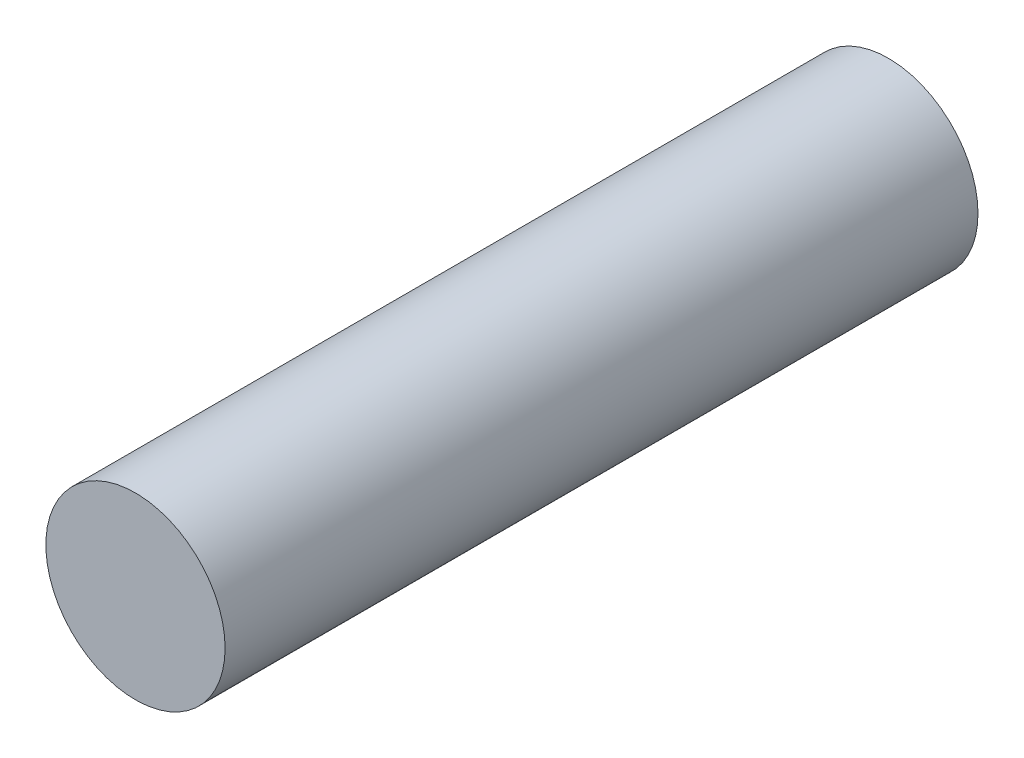
ISO-10303-21;
HEADER;
FILE_DESCRIPTION(('STEP AP214'),'2;1');
FILE_NAME('part.step','',(''),(''),'','','');
FILE_SCHEMA(('AUTOMOTIVE_DESIGN { 1 0 10303 214 1 1 1 1 }'));
ENDSEC;
DATA;
#1=APPLICATION_CONTEXT('core data for automotive mechanical design processes');
#2=APPLICATION_PROTOCOL_DEFINITION('international standard','automotive_design',2000,#1);
#3=PRODUCT_CONTEXT('',#1,'mechanical');
#4=PRODUCT('Part','Part','',(#3));
#5=PRODUCT_RELATED_PRODUCT_CATEGORY('part','',(#4));
#6=PRODUCT_DEFINITION_FORMATION('','',#4);
#7=PRODUCT_DEFINITION_CONTEXT('part definition',#1,'design');
#8=PRODUCT_DEFINITION('design','',#6,#7);
#9=PRODUCT_DEFINITION_SHAPE('','',#8);
#10=(LENGTH_UNIT() NAMED_UNIT(*) SI_UNIT(.MILLI.,.METRE.));
#11=(NAMED_UNIT(*) PLANE_ANGLE_UNIT() SI_UNIT($,.RADIAN.));
#12=(NAMED_UNIT(*) SI_UNIT($,.STERADIAN.) SOLID_ANGLE_UNIT());
#13=UNCERTAINTY_MEASURE_WITH_UNIT(LENGTH_MEASURE(1.E-05),#10,'distance_accuracy_value','');
#14=(GEOMETRIC_REPRESENTATION_CONTEXT(3) GLOBAL_UNCERTAINTY_ASSIGNED_CONTEXT((#13)) GLOBAL_UNIT_ASSIGNED_CONTEXT((#10,
#11,#12)) REPRESENTATION_CONTEXT('',''));
#15=CARTESIAN_POINT('',(0.,0.,0.));
#16=DIRECTION('',(0.,0.,1.));
#17=DIRECTION('',(1.,0.,0.));
#18=AXIS2_PLACEMENT_3D('',#15,#16,#17);
#19=CARTESIAN_POINT('',(0.,0.,63.));
#20=DIRECTION('',(0.,0.,-1.));
#21=DIRECTION('',(-1.,0.,0.));
#22=AXIS2_PLACEMENT_3D('',#19,#20,#21);
#23=CYLINDRICAL_SURFACE('',#22,7.5);
#24=CARTESIAN_POINT('',(0.,0.,63.));
#25=DIRECTION('',(0.,0.,1.));
#26=DIRECTION('',(1.,0.,0.));
#27=AXIS2_PLACEMENT_3D('',#24,#25,#26);
#28=CIRCLE('',#27,7.5);
#29=CARTESIAN_POINT('',(7.5,0.,63.));
#30=VERTEX_POINT('',#29);
#31=EDGE_CURVE('E10',#30,#30,#28,.T.);
#32=ORIENTED_EDGE('',*,*,#31,.F.);
#33=EDGE_LOOP('',(#32));
#34=FACE_BOUND('',#33,.T.);
#35=CARTESIAN_POINT('',(0.,0.,0.));
#36=DIRECTION('',(0.,0.,1.));
#37=DIRECTION('',(1.,0.,0.));
#38=AXIS2_PLACEMENT_3D('',#35,#36,#37);
#39=CIRCLE('',#38,7.5);
#40=CARTESIAN_POINT('',(7.5,0.,0.));
#41=VERTEX_POINT('',#40);
#42=EDGE_CURVE('E44',#41,#41,#39,.T.);
#43=ORIENTED_EDGE('',*,*,#42,.T.);
#44=EDGE_LOOP('',(#43));
#45=FACE_BOUND('',#44,.T.);
#46=ADVANCED_FACE('F41',(#34,#45),#23,.T.);
#47=CARTESIAN_POINT('',(0.,0.,63.));
#48=DIRECTION('',(0.,0.,1.));
#49=DIRECTION('',(1.,0.,0.));
#50=AXIS2_PLACEMENT_3D('',#47,#48,#49);
#51=PLANE('',#50);
#52=ORIENTED_EDGE('',*,*,#31,.T.);
#53=EDGE_LOOP('',(#52));
#54=FACE_BOUND('',#53,.T.);
#55=ADVANCED_FACE('F58',(#54),#51,.T.);
#56=CARTESIAN_POINT('',(0.,0.,0.));
#57=DIRECTION('',(0.,0.,1.));
#58=DIRECTION('',(1.,0.,0.));
#59=AXIS2_PLACEMENT_3D('',#56,#57,#58);
#60=PLANE('',#59);
#61=ORIENTED_EDGE('',*,*,#42,.F.);
#62=EDGE_LOOP('',(#61));
#63=FACE_BOUND('',#62,.T.);
#64=ADVANCED_FACE('F56',(#63),#60,.F.);
#65=CLOSED_SHELL('',(#46,#55,#64));
#66=MANIFOLD_SOLID_BREP('B2',#65);
#67=ADVANCED_BREP_SHAPE_REPRESENTATION('',(#18,#66),#14);
#68=SHAPE_DEFINITION_REPRESENTATION(#9,#67);
ENDSEC;
END-ISO-10303-21;
